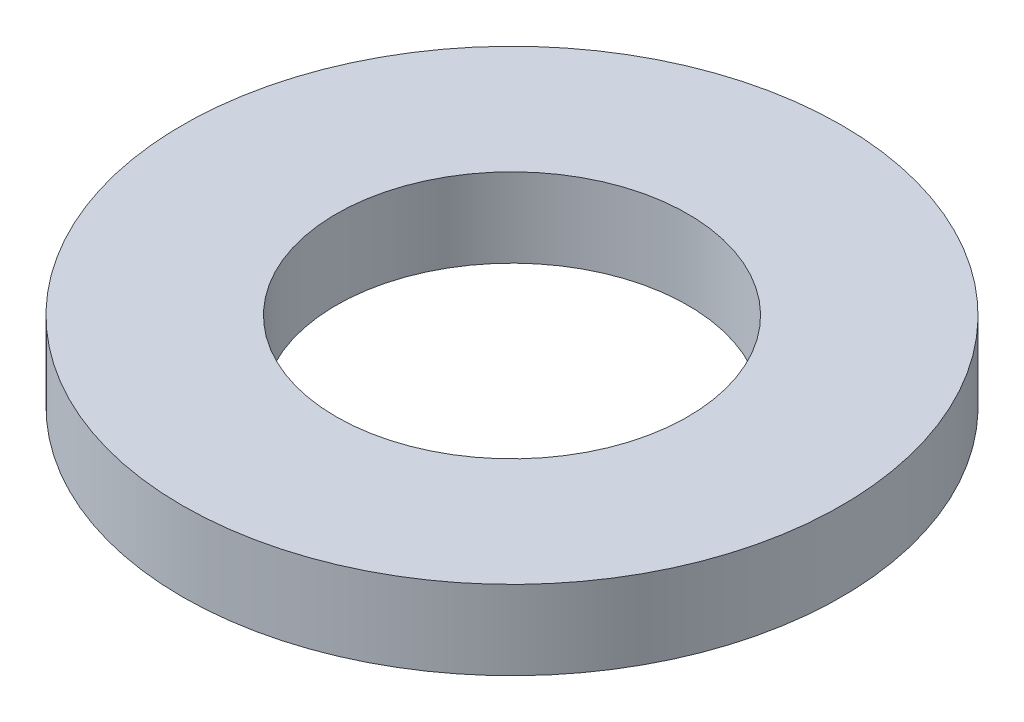
ISO-10303-21;
HEADER;
FILE_DESCRIPTION(('STEP AP214'),'2;1');
FILE_NAME('part.step','',(''),(''),'','','');
FILE_SCHEMA(('AUTOMOTIVE_DESIGN { 1 0 10303 214 1 1 1 1 }'));
ENDSEC;
DATA;
#1=APPLICATION_CONTEXT('core data for automotive mechanical design processes');
#2=APPLICATION_PROTOCOL_DEFINITION('international standard','automotive_design',2000,#1);
#3=PRODUCT_CONTEXT('',#1,'mechanical');
#4=PRODUCT('Part','Part','',(#3));
#5=PRODUCT_RELATED_PRODUCT_CATEGORY('part','',(#4));
#6=PRODUCT_DEFINITION_FORMATION('','',#4);
#7=PRODUCT_DEFINITION_CONTEXT('part definition',#1,'design');
#8=PRODUCT_DEFINITION('design','',#6,#7);
#9=PRODUCT_DEFINITION_SHAPE('','',#8);
#10=(LENGTH_UNIT() NAMED_UNIT(*) SI_UNIT(.MILLI.,.METRE.));
#11=(NAMED_UNIT(*) PLANE_ANGLE_UNIT() SI_UNIT($,.RADIAN.));
#12=(NAMED_UNIT(*) SI_UNIT($,.STERADIAN.) SOLID_ANGLE_UNIT());
#13=UNCERTAINTY_MEASURE_WITH_UNIT(LENGTH_MEASURE(1.E-05),#10,'distance_accuracy_value','');
#14=(GEOMETRIC_REPRESENTATION_CONTEXT(3) GLOBAL_UNCERTAINTY_ASSIGNED_CONTEXT((#13)) GLOBAL_UNIT_ASSIGNED_CONTEXT((#10,
#11,#12)) REPRESENTATION_CONTEXT('',''));
#15=CARTESIAN_POINT('',(0.,0.,0.));
#16=DIRECTION('',(0.,0.,1.));
#17=DIRECTION('',(1.,0.,0.));
#18=AXIS2_PLACEMENT_3D('',#15,#16,#17);
#19=CARTESIAN_POINT('',(0.,9.,0.));
#20=DIRECTION('',(0.,-1.,0.));
#21=DIRECTION('',(0.,0.,-1.));
#22=AXIS2_PLACEMENT_3D('',#19,#20,#21);
#23=CYLINDRICAL_SURFACE('',#22,37.5);
#24=CARTESIAN_POINT('',(0.,9.,0.));
#25=DIRECTION('',(0.,1.,0.));
#26=DIRECTION('',(0.,0.,1.));
#27=AXIS2_PLACEMENT_3D('',#24,#25,#26);
#28=CIRCLE('',#27,37.5);
#29=CARTESIAN_POINT('',(0.,9.,37.5));
#30=VERTEX_POINT('',#29);
#31=EDGE_CURVE('E10',#30,#30,#28,.T.);
#32=ORIENTED_EDGE('',*,*,#31,.F.);
#33=EDGE_LOOP('',(#32));
#34=FACE_BOUND('',#33,.T.);
#35=CARTESIAN_POINT('',(0.,0.,0.));
#36=DIRECTION('',(0.,1.,0.));
#37=DIRECTION('',(0.,0.,1.));
#38=AXIS2_PLACEMENT_3D('',#35,#36,#37);
#39=CIRCLE('',#38,37.5);
#40=CARTESIAN_POINT('',(0.,0.,37.5));
#41=VERTEX_POINT('',#40);
#42=EDGE_CURVE('E37',#41,#41,#39,.T.);
#43=ORIENTED_EDGE('',*,*,#42,.T.);
#44=EDGE_LOOP('',(#43));
#45=FACE_BOUND('',#44,.T.);
#46=ADVANCED_FACE('F40',(#34,#45),#23,.T.);
#47=CARTESIAN_POINT('',(0.,9.,0.));
#48=DIRECTION('',(0.,1.,0.));
#49=DIRECTION('',(0.,0.,1.));
#50=AXIS2_PLACEMENT_3D('',#47,#48,#49);
#51=PLANE('',#50);
#52=CARTESIAN_POINT('',(0.,9.,0.));
#53=DIRECTION('',(0.,1.,0.));
#54=DIRECTION('',(0.,0.,1.));
#55=AXIS2_PLACEMENT_3D('',#52,#53,#54);
#56=CIRCLE('',#55,20.);
#57=CARTESIAN_POINT('',(0.,9.,20.));
#58=VERTEX_POINT('',#57);
#59=EDGE_CURVE('E50',#58,#58,#56,.T.);
#60=ORIENTED_EDGE('',*,*,#59,.F.);
#61=EDGE_LOOP('',(#60));
#62=FACE_BOUND('',#61,.T.);
#63=ORIENTED_EDGE('',*,*,#31,.T.);
#64=EDGE_LOOP('',(#63));
#65=FACE_BOUND('',#64,.T.);
#66=ADVANCED_FACE('F59',(#62,#65),#51,.T.);
#67=CARTESIAN_POINT('',(0.,0.,0.));
#68=DIRECTION('',(0.,1.,0.));
#69=DIRECTION('',(0.,0.,1.));
#70=AXIS2_PLACEMENT_3D('',#67,#68,#69);
#71=PLANE('',#70);
#72=CARTESIAN_POINT('',(0.,0.,0.));
#73=DIRECTION('',(0.,1.,0.));
#74=DIRECTION('',(0.,0.,1.));
#75=AXIS2_PLACEMENT_3D('',#72,#73,#74);
#76=CIRCLE('',#75,20.);
#77=CARTESIAN_POINT('',(0.,0.,20.));
#78=VERTEX_POINT('',#77);
#79=EDGE_CURVE('E47',#78,#78,#76,.T.);
#80=ORIENTED_EDGE('',*,*,#79,.T.);
#81=EDGE_LOOP('',(#80));
#82=FACE_BOUND('',#81,.T.);
#83=ORIENTED_EDGE('',*,*,#42,.F.);
#84=EDGE_LOOP('',(#83));
#85=FACE_BOUND('',#84,.T.);
#86=ADVANCED_FACE('F58',(#82,#85),#71,.F.);
#87=CARTESIAN_POINT('',(0.,9.,0.));
#88=DIRECTION('',(0.,-1.,0.));
#89=DIRECTION('',(0.,0.,-1.));
#90=AXIS2_PLACEMENT_3D('',#87,#88,#89);
#91=CYLINDRICAL_SURFACE('',#90,20.);
#92=ORIENTED_EDGE('',*,*,#59,.T.);
#93=EDGE_LOOP('',(#92));
#94=FACE_BOUND('',#93,.T.);
#95=ORIENTED_EDGE('',*,*,#79,.F.);
#96=EDGE_LOOP('',(#95));
#97=FACE_BOUND('',#96,.T.);
#98=ADVANCED_FACE('F54',(#94,#97),#91,.F.);
#99=CLOSED_SHELL('',(#46,#66,#86,#98));
#100=MANIFOLD_SOLID_BREP('B2',#99);
#101=ADVANCED_BREP_SHAPE_REPRESENTATION('',(#18,#100),#14);
#102=SHAPE_DEFINITION_REPRESENTATION(#9,#101);
ENDSEC;
END-ISO-10303-21;
